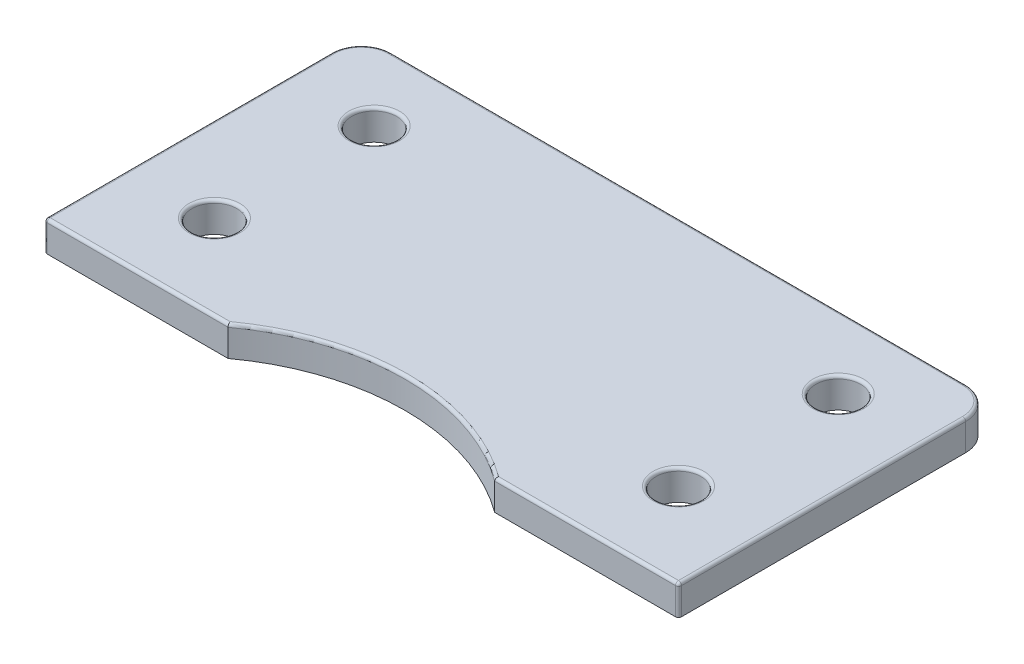
ISO-10303-21;
HEADER;
FILE_DESCRIPTION(('STEP AP214'),'2;1');
FILE_NAME('part.step','',(''),(''),'','','');
FILE_SCHEMA(('AUTOMOTIVE_DESIGN { 1 0 10303 214 1 1 1 1 }'));
ENDSEC;
DATA;
#1=APPLICATION_CONTEXT('core data for automotive mechanical design processes');
#2=APPLICATION_PROTOCOL_DEFINITION('international standard','automotive_design',2000,#1);
#3=PRODUCT_CONTEXT('',#1,'mechanical');
#4=PRODUCT('Part','Part','',(#3));
#5=PRODUCT_RELATED_PRODUCT_CATEGORY('part','',(#4));
#6=PRODUCT_DEFINITION_FORMATION('','',#4);
#7=PRODUCT_DEFINITION_CONTEXT('part definition',#1,'design');
#8=PRODUCT_DEFINITION('design','',#6,#7);
#9=PRODUCT_DEFINITION_SHAPE('','',#8);
#10=(LENGTH_UNIT() NAMED_UNIT(*) SI_UNIT(.MILLI.,.METRE.));
#11=(NAMED_UNIT(*) PLANE_ANGLE_UNIT() SI_UNIT($,.RADIAN.));
#12=(NAMED_UNIT(*) SI_UNIT($,.STERADIAN.) SOLID_ANGLE_UNIT());
#13=UNCERTAINTY_MEASURE_WITH_UNIT(LENGTH_MEASURE(1.E-05),#10,'distance_accuracy_value','');
#14=(GEOMETRIC_REPRESENTATION_CONTEXT(3) GLOBAL_UNCERTAINTY_ASSIGNED_CONTEXT((#13)) GLOBAL_UNIT_ASSIGNED_CONTEXT((#10,
#11,#12)) REPRESENTATION_CONTEXT('',''));
#15=CARTESIAN_POINT('',(0.,0.,0.));
#16=DIRECTION('',(0.,0.,1.));
#17=DIRECTION('',(1.,0.,0.));
#18=AXIS2_PLACEMENT_3D('',#15,#16,#17);
#19=CARTESIAN_POINT('',(0.,2.,33.3221138725638));
#20=DIRECTION('',(0.,1.,0.));
#21=DIRECTION('',(0.,0.,1.));
#22=AXIS2_PLACEMENT_3D('',#19,#20,#21);
#23=PLANE('',#22);
#24=CARTESIAN_POINT('',(-15.4497179784894,2.,4.84788901423793));
#25=DIRECTION('',(0.,1.,0.));
#26=DIRECTION('',(0.,0.,1.));
#27=AXIS2_PLACEMENT_3D('',#24,#25,#26);
#28=CIRCLE('',#27,1.7);
#29=CARTESIAN_POINT('',(-15.4497179784894,2.,6.54788901423793));
#30=VERTEX_POINT('',#29);
#31=EDGE_CURVE('E222',#30,#30,#28,.F.);
#32=ORIENTED_EDGE('',*,*,#31,.T.);
#33=EDGE_LOOP('',(#32));
#34=FACE_BOUND('',#33,.T.);
#35=CARTESIAN_POINT('',(15.5,2.,15.5));
#36=DIRECTION('',(0.,1.,0.));
#37=DIRECTION('',(0.,0.,1.));
#38=AXIS2_PLACEMENT_3D('',#35,#36,#37);
#39=CIRCLE('',#38,1.7);
#40=CARTESIAN_POINT('',(15.5,2.,17.2));
#41=VERTEX_POINT('',#40);
#42=EDGE_CURVE('E219',#41,#41,#39,.F.);
#43=ORIENTED_EDGE('',*,*,#42,.T.);
#44=EDGE_LOOP('',(#43));
#45=FACE_BOUND('',#44,.T.);
#46=DIRECTION('',(0.,0.,-1.));
#47=VECTOR('',#46,1.);
#48=CARTESIAN_POINT('',(20.95,2.,2.00000000000001));
#49=LINE('',#48,#47);
#50=CARTESIAN_POINT('',(20.95,2.,20.95));
#51=VERTEX_POINT('',#50);
#52=CARTESIAN_POINT('',(20.95,2.,2.));
#53=VERTEX_POINT('',#52);
#54=EDGE_CURVE('E214',#51,#53,#49,.T.);
#55=ORIENTED_EDGE('',*,*,#54,.T.);
#56=CARTESIAN_POINT('',(19.15,2.,2.));
#57=DIRECTION('',(0.,1.,0.));
#58=DIRECTION('',(0.,0.,1.));
#59=AXIS2_PLACEMENT_3D('',#56,#57,#58);
#60=CIRCLE('',#59,1.8);
#61=CARTESIAN_POINT('',(19.15,2.,0.199999999999999));
#62=VERTEX_POINT('',#61);
#63=EDGE_CURVE('E216',#53,#62,#60,.T.);
#64=ORIENTED_EDGE('',*,*,#63,.T.);
#65=DIRECTION('',(-1.,0.,0.));
#66=VECTOR('',#65,1.);
#67=CARTESIAN_POINT('',(-19.15,2.,0.199999999999999));
#68=LINE('',#67,#66);
#69=CARTESIAN_POINT('',(-19.15,2.,0.199999999999999));
#70=VERTEX_POINT('',#69);
#71=EDGE_CURVE('E202',#62,#70,#68,.T.);
#72=ORIENTED_EDGE('',*,*,#71,.T.);
#73=CARTESIAN_POINT('',(-19.15,2.,2.));
#74=DIRECTION('',(0.,1.,0.));
#75=DIRECTION('',(0.,0.,1.));
#76=AXIS2_PLACEMENT_3D('',#73,#74,#75);
#77=CIRCLE('',#76,1.8);
#78=CARTESIAN_POINT('',(-20.95,2.,2.));
#79=VERTEX_POINT('',#78);
#80=EDGE_CURVE('E204',#70,#79,#77,.T.);
#81=ORIENTED_EDGE('',*,*,#80,.T.);
#82=DIRECTION('',(0.,0.,1.));
#83=VECTOR('',#82,1.);
#84=CARTESIAN_POINT('',(-20.95,2.,21.15));
#85=LINE('',#84,#83);
#86=CARTESIAN_POINT('',(-20.95,2.,20.95));
#87=VERTEX_POINT('',#86);
#88=EDGE_CURVE('E206',#79,#87,#85,.T.);
#89=ORIENTED_EDGE('',*,*,#88,.T.);
#90=DIRECTION('',(1.,0.,0.));
#91=VECTOR('',#90,1.);
#92=CARTESIAN_POINT('',(-8.891728160656,2.,20.95));
#93=LINE('',#92,#91);
#94=CARTESIAN_POINT('',(-8.95676022610485,2.,20.95));
#95=VERTEX_POINT('',#94);
#96=EDGE_CURVE('E208',#87,#95,#93,.T.);
#97=ORIENTED_EDGE('',*,*,#96,.T.);
#98=CARTESIAN_POINT('',(0.,2.,33.3221138725638));
#99=DIRECTION('',(0.,1.,0.));
#100=DIRECTION('',(0.,0.,1.));
#101=AXIS2_PLACEMENT_3D('',#98,#99,#100);
#102=CIRCLE('',#101,15.2739240348909);
#103=CARTESIAN_POINT('',(8.95676022610484,2.,20.95));
#104=VERTEX_POINT('',#103);
#105=EDGE_CURVE('E210',#95,#104,#102,.F.);
#106=ORIENTED_EDGE('',*,*,#105,.T.);
#107=DIRECTION('',(1.,0.,0.));
#108=VECTOR('',#107,1.);
#109=CARTESIAN_POINT('',(21.15,2.,20.95));
#110=LINE('',#109,#108);
#111=EDGE_CURVE('E212',#104,#51,#110,.T.);
#112=ORIENTED_EDGE('',*,*,#111,.T.);
#113=EDGE_LOOP('',(#55,#64,#72,#81,#89,#97,#106,#112));
#114=FACE_BOUND('',#113,.T.);
#115=CARTESIAN_POINT('',(-15.4497179784894,2.,15.5));
#116=DIRECTION('',(0.,1.,0.));
#117=DIRECTION('',(0.,0.,1.));
#118=AXIS2_PLACEMENT_3D('',#115,#116,#117);
#119=CIRCLE('',#118,1.7);
#120=CARTESIAN_POINT('',(-15.4497179784894,2.,17.2));
#121=VERTEX_POINT('',#120);
#122=EDGE_CURVE('E199',#121,#121,#119,.F.);
#123=ORIENTED_EDGE('',*,*,#122,.T.);
#124=EDGE_LOOP('',(#123));
#125=FACE_BOUND('',#124,.T.);
#126=CARTESIAN_POINT('',(15.5,2.,4.84788901423793));
#127=DIRECTION('',(0.,1.,0.));
#128=DIRECTION('',(0.,0.,1.));
#129=AXIS2_PLACEMENT_3D('',#126,#127,#128);
#130=CIRCLE('',#129,1.7);
#131=CARTESIAN_POINT('',(15.5,2.,6.54788901423793));
#132=VERTEX_POINT('',#131);
#133=EDGE_CURVE('E196',#132,#132,#130,.F.);
#134=ORIENTED_EDGE('',*,*,#133,.T.);
#135=EDGE_LOOP('',(#134));
#136=FACE_BOUND('',#135,.T.);
#137=ADVANCED_FACE('F33',(#34,#45,#114,#125,#136),#23,.T.);
#138=CARTESIAN_POINT('',(0.,0.,33.3221138725638));
#139=DIRECTION('',(0.,1.,0.));
#140=DIRECTION('',(0.,0.,1.));
#141=AXIS2_PLACEMENT_3D('',#138,#139,#140);
#142=PLANE('',#141);
#143=DIRECTION('',(1.,0.,0.));
#144=VECTOR('',#143,1.);
#145=CARTESIAN_POINT('',(-21.15,0.,21.15));
#146=LINE('',#145,#144);
#147=CARTESIAN_POINT('',(-20.95,0.,21.15));
#148=VERTEX_POINT('',#147);
#149=CARTESIAN_POINT('',(-8.891728160656,0.,21.15));
#150=VERTEX_POINT('',#149);
#151=EDGE_CURVE('E143',#148,#150,#146,.T.);
#152=ORIENTED_EDGE('',*,*,#151,.F.);
#153=CARTESIAN_POINT('',(-20.95,0.,20.95));
#154=DIRECTION('',(0.,1.,0.));
#155=DIRECTION('',(0.,0.,1.));
#156=AXIS2_PLACEMENT_3D('',#153,#154,#155);
#157=CIRCLE('',#156,0.2);
#158=CARTESIAN_POINT('',(-21.15,0.,20.95));
#159=VERTEX_POINT('',#158);
#160=EDGE_CURVE('E11',#148,#159,#157,.F.);
#161=ORIENTED_EDGE('',*,*,#160,.T.);
#162=DIRECTION('',(0.,0.,1.));
#163=VECTOR('',#162,1.);
#164=CARTESIAN_POINT('',(-21.15,0.,0.));
#165=LINE('',#164,#163);
#166=CARTESIAN_POINT('',(-21.15,0.,2.));
#167=VERTEX_POINT('',#166);
#168=EDGE_CURVE('E154',#167,#159,#165,.T.);
#169=ORIENTED_EDGE('',*,*,#168,.F.);
#170=CARTESIAN_POINT('',(-19.15,0.,2.));
#171=DIRECTION('',(0.,1.,0.));
#172=DIRECTION('',(0.,0.,1.));
#173=AXIS2_PLACEMENT_3D('',#170,#171,#172);
#174=CIRCLE('',#173,2.);
#175=CARTESIAN_POINT('',(-19.15,0.,0.));
#176=VERTEX_POINT('',#175);
#177=EDGE_CURVE('E184',#167,#176,#174,.F.);
#178=ORIENTED_EDGE('',*,*,#177,.T.);
#179=DIRECTION('',(-1.,0.,0.));
#180=VECTOR('',#179,1.);
#181=CARTESIAN_POINT('',(21.15,0.,0.));
#182=LINE('',#181,#180);
#183=CARTESIAN_POINT('',(19.15,0.,0.));
#184=VERTEX_POINT('',#183);
#185=EDGE_CURVE('E176',#184,#176,#182,.T.);
#186=ORIENTED_EDGE('',*,*,#185,.F.);
#187=CARTESIAN_POINT('',(19.15,0.,2.));
#188=DIRECTION('',(0.,1.,0.));
#189=DIRECTION('',(0.,0.,1.));
#190=AXIS2_PLACEMENT_3D('',#187,#188,#189);
#191=CIRCLE('',#190,2.);
#192=CARTESIAN_POINT('',(21.15,0.,2.00000000000001));
#193=VERTEX_POINT('',#192);
#194=EDGE_CURVE('E181',#184,#193,#191,.F.);
#195=ORIENTED_EDGE('',*,*,#194,.T.);
#196=DIRECTION('',(0.,0.,-1.));
#197=VECTOR('',#196,1.);
#198=CARTESIAN_POINT('',(21.15,0.,21.15));
#199=LINE('',#198,#197);
#200=CARTESIAN_POINT('',(21.15,0.,20.95));
#201=VERTEX_POINT('',#200);
#202=EDGE_CURVE('E171',#201,#193,#199,.T.);
#203=ORIENTED_EDGE('',*,*,#202,.F.);
#204=CARTESIAN_POINT('',(20.95,0.,20.95));
#205=DIRECTION('',(0.,1.,0.));
#206=DIRECTION('',(0.,0.,1.));
#207=AXIS2_PLACEMENT_3D('',#204,#205,#206);
#208=CIRCLE('',#207,0.2);
#209=CARTESIAN_POINT('',(20.95,0.,21.15));
#210=VERTEX_POINT('',#209);
#211=EDGE_CURVE('E47',#201,#210,#208,.F.);
#212=ORIENTED_EDGE('',*,*,#211,.T.);
#213=DIRECTION('',(1.,0.,0.));
#214=VECTOR('',#213,1.);
#215=CARTESIAN_POINT('',(8.89172816065599,0.,21.15));
#216=LINE('',#215,#214);
#217=CARTESIAN_POINT('',(8.89172816065599,0.,21.15));
#218=VERTEX_POINT('',#217);
#219=EDGE_CURVE('E169',#218,#210,#216,.T.);
#220=ORIENTED_EDGE('',*,*,#219,.F.);
#221=CARTESIAN_POINT('',(0.,0.,33.3221138725638));
#222=DIRECTION('',(0.,-1.,0.));
#223=DIRECTION('',(0.,0.,1.));
#224=AXIS2_PLACEMENT_3D('',#221,#222,#223);
#225=CIRCLE('',#224,15.0739240348909);
#226=EDGE_CURVE('E153',#150,#218,#225,.T.);
#227=ORIENTED_EDGE('',*,*,#226,.F.);
#228=EDGE_LOOP('',(#152,#161,#169,#178,#186,#195,#203,#212,#220,#227));
#229=FACE_BOUND('',#228,.T.);
#230=CARTESIAN_POINT('',(-15.4497179784894,0.,15.5));
#231=DIRECTION('',(0.,1.,0.));
#232=DIRECTION('',(0.,0.,1.));
#233=AXIS2_PLACEMENT_3D('',#230,#231,#232);
#234=CIRCLE('',#233,1.5);
#235=CARTESIAN_POINT('',(-15.4497179784894,0.,17.));
#236=VERTEX_POINT('',#235);
#237=EDGE_CURVE('E414',#236,#236,#234,.T.);
#238=ORIENTED_EDGE('',*,*,#237,.T.);
#239=EDGE_LOOP('',(#238));
#240=FACE_BOUND('',#239,.T.);
#241=CARTESIAN_POINT('',(15.5,0.,15.5));
#242=DIRECTION('',(0.,1.,0.));
#243=DIRECTION('',(0.,0.,1.));
#244=AXIS2_PLACEMENT_3D('',#241,#242,#243);
#245=CIRCLE('',#244,1.5);
#246=CARTESIAN_POINT('',(15.5,0.,17.));
#247=VERTEX_POINT('',#246);
#248=EDGE_CURVE('E409',#247,#247,#245,.T.);
#249=ORIENTED_EDGE('',*,*,#248,.T.);
#250=EDGE_LOOP('',(#249));
#251=FACE_BOUND('',#250,.T.);
#252=CARTESIAN_POINT('',(15.5,0.,4.84788901423793));
#253=DIRECTION('',(0.,1.,0.));
#254=DIRECTION('',(0.,0.,1.));
#255=AXIS2_PLACEMENT_3D('',#252,#253,#254);
#256=CIRCLE('',#255,1.5);
#257=CARTESIAN_POINT('',(15.5,0.,6.34788901423793));
#258=VERTEX_POINT('',#257);
#259=EDGE_CURVE('E404',#258,#258,#256,.T.);
#260=ORIENTED_EDGE('',*,*,#259,.T.);
#261=EDGE_LOOP('',(#260));
#262=FACE_BOUND('',#261,.T.);
#263=CARTESIAN_POINT('',(-15.4497179784894,0.,4.84788901423793));
#264=DIRECTION('',(0.,1.,0.));
#265=DIRECTION('',(0.,0.,1.));
#266=AXIS2_PLACEMENT_3D('',#263,#264,#265);
#267=CIRCLE('',#266,1.5);
#268=CARTESIAN_POINT('',(-15.4497179784894,0.,6.34788901423793));
#269=VERTEX_POINT('',#268);
#270=EDGE_CURVE('E399',#269,#269,#267,.T.);
#271=ORIENTED_EDGE('',*,*,#270,.T.);
#272=EDGE_LOOP('',(#271));
#273=FACE_BOUND('',#272,.T.);
#274=ADVANCED_FACE('F166',(#229,#240,#251,#262,#273),#142,.F.);
#275=CARTESIAN_POINT('',(-21.15,2.,0.));
#276=DIRECTION('',(1.,0.,0.));
#277=DIRECTION('',(0.,0.,-1.));
#278=AXIS2_PLACEMENT_3D('',#275,#276,#277);
#279=PLANE('',#278);
#280=DIRECTION('',(0.,-1.,0.));
#281=VECTOR('',#280,1.);
#282=CARTESIAN_POINT('',(-21.15,2.,20.95));
#283=LINE('',#282,#281);
#284=CARTESIAN_POINT('',(-21.15,1.8,20.95));
#285=VERTEX_POINT('',#284);
#286=EDGE_CURVE('E63',#159,#285,#283,.F.);
#287=ORIENTED_EDGE('',*,*,#286,.T.);
#288=DIRECTION('',(0.,0.,1.));
#289=VECTOR('',#288,1.);
#290=CARTESIAN_POINT('',(-21.15,1.8,2.));
#291=LINE('',#290,#289);
#292=CARTESIAN_POINT('',(-21.15,1.8,2.));
#293=VERTEX_POINT('',#292);
#294=EDGE_CURVE('E244',#285,#293,#291,.F.);
#295=ORIENTED_EDGE('',*,*,#294,.T.);
#296=DIRECTION('',(0.,-1.,0.));
#297=VECTOR('',#296,1.);
#298=CARTESIAN_POINT('',(-21.15,2.,2.));
#299=LINE('',#298,#297);
#300=EDGE_CURVE('E163',#293,#167,#299,.T.);
#301=ORIENTED_EDGE('',*,*,#300,.T.);
#302=ORIENTED_EDGE('',*,*,#168,.T.);
#303=EDGE_LOOP('',(#287,#295,#301,#302));
#304=FACE_BOUND('',#303,.T.);
#305=ADVANCED_FACE('F331',(#304),#279,.F.);
#306=CARTESIAN_POINT('',(-21.15,2.,21.15));
#307=DIRECTION('',(0.,0.,-1.));
#308=DIRECTION('',(-1.,0.,0.));
#309=AXIS2_PLACEMENT_3D('',#306,#307,#308);
#310=PLANE('',#309);
#311=DIRECTION('',(0.,-1.,0.));
#312=VECTOR('',#311,1.);
#313=CARTESIAN_POINT('',(-8.891728160656,2.,21.15));
#314=LINE('',#313,#312);
#315=CARTESIAN_POINT('',(-8.891728160656,1.8,21.15));
#316=VERTEX_POINT('',#315);
#317=EDGE_CURVE('E146',#316,#150,#314,.T.);
#318=ORIENTED_EDGE('',*,*,#317,.F.);
#319=DIRECTION('',(1.,0.,0.));
#320=VECTOR('',#319,1.);
#321=CARTESIAN_POINT('',(-21.15,1.8,21.15));
#322=LINE('',#321,#320);
#323=CARTESIAN_POINT('',(-20.95,1.8,21.15));
#324=VERTEX_POINT('',#323);
#325=EDGE_CURVE('E241',#316,#324,#322,.F.);
#326=ORIENTED_EDGE('',*,*,#325,.T.);
#327=DIRECTION('',(0.,-1.,0.));
#328=VECTOR('',#327,1.);
#329=CARTESIAN_POINT('',(-20.95,2.,21.15));
#330=LINE('',#329,#328);
#331=EDGE_CURVE('E149',#324,#148,#330,.T.);
#332=ORIENTED_EDGE('',*,*,#331,.T.);
#333=ORIENTED_EDGE('',*,*,#151,.T.);
#334=EDGE_LOOP('',(#318,#326,#332,#333));
#335=FACE_BOUND('',#334,.T.);
#336=ADVANCED_FACE('F145',(#335),#310,.F.);
#337=CARTESIAN_POINT('',(0.,2.,33.3221138725638));
#338=DIRECTION('',(0.,-1.,0.));
#339=DIRECTION('',(0.,0.,-1.));
#340=AXIS2_PLACEMENT_3D('',#337,#338,#339);
#341=CYLINDRICAL_SURFACE('',#340,15.0739240348909);
#342=DIRECTION('',(0.,-1.,0.));
#343=VECTOR('',#342,1.);
#344=CARTESIAN_POINT('',(8.89172816065599,2.,21.15));
#345=LINE('',#344,#343);
#346=CARTESIAN_POINT('',(8.89172816065599,1.8,21.15));
#347=VERTEX_POINT('',#346);
#348=EDGE_CURVE('E164',#347,#218,#345,.T.);
#349=ORIENTED_EDGE('',*,*,#348,.F.);
#350=CARTESIAN_POINT('',(0.,1.8,33.3221138725638));
#351=DIRECTION('',(0.,1.,0.));
#352=DIRECTION('',(0.,0.,1.));
#353=AXIS2_PLACEMENT_3D('',#350,#351,#352);
#354=CIRCLE('',#353,15.0739240348909);
#355=EDGE_CURVE('E162',#347,#316,#354,.T.);
#356=ORIENTED_EDGE('',*,*,#355,.T.);
#357=ORIENTED_EDGE('',*,*,#317,.T.);
#358=ORIENTED_EDGE('',*,*,#226,.T.);
#359=EDGE_LOOP('',(#349,#356,#357,#358));
#360=FACE_BOUND('',#359,.T.);
#361=ADVANCED_FACE('F159',(#360),#341,.F.);
#362=CARTESIAN_POINT('',(8.89172816065599,2.,21.15));
#363=DIRECTION('',(0.,0.,-1.));
#364=DIRECTION('',(-1.,0.,0.));
#365=AXIS2_PLACEMENT_3D('',#362,#363,#364);
#366=PLANE('',#365);
#367=DIRECTION('',(0.,-1.,0.));
#368=VECTOR('',#367,1.);
#369=CARTESIAN_POINT('',(20.95,2.,21.15));
#370=LINE('',#369,#368);
#371=CARTESIAN_POINT('',(20.95,1.8,21.15));
#372=VERTEX_POINT('',#371);
#373=EDGE_CURVE('E235',#210,#372,#370,.F.);
#374=ORIENTED_EDGE('',*,*,#373,.T.);
#375=DIRECTION('',(1.,0.,0.));
#376=VECTOR('',#375,1.);
#377=CARTESIAN_POINT('',(8.89172816065599,1.8,21.15));
#378=LINE('',#377,#376);
#379=EDGE_CURVE('E237',#372,#347,#378,.F.);
#380=ORIENTED_EDGE('',*,*,#379,.T.);
#381=ORIENTED_EDGE('',*,*,#348,.T.);
#382=ORIENTED_EDGE('',*,*,#219,.T.);
#383=EDGE_LOOP('',(#374,#380,#381,#382));
#384=FACE_BOUND('',#383,.T.);
#385=ADVANCED_FACE('F345',(#384),#366,.F.);
#386=CARTESIAN_POINT('',(21.15,2.,21.15));
#387=DIRECTION('',(-1.,0.,0.));
#388=DIRECTION('',(0.,0.,1.));
#389=AXIS2_PLACEMENT_3D('',#386,#387,#388);
#390=PLANE('',#389);
#391=DIRECTION('',(0.,-1.,0.));
#392=VECTOR('',#391,1.);
#393=CARTESIAN_POINT('',(21.15,2.,2.));
#394=LINE('',#393,#392);
#395=CARTESIAN_POINT('',(21.15,1.8,2.));
#396=VERTEX_POINT('',#395);
#397=EDGE_CURVE('E190',#193,#396,#394,.F.);
#398=ORIENTED_EDGE('',*,*,#397,.T.);
#399=DIRECTION('',(0.,0.,-1.));
#400=VECTOR('',#399,1.);
#401=CARTESIAN_POINT('',(21.15,1.8,21.15));
#402=LINE('',#401,#400);
#403=CARTESIAN_POINT('',(21.15,1.8,20.95));
#404=VERTEX_POINT('',#403);
#405=EDGE_CURVE('E233',#396,#404,#402,.F.);
#406=ORIENTED_EDGE('',*,*,#405,.T.);
#407=DIRECTION('',(0.,-1.,0.));
#408=VECTOR('',#407,1.);
#409=CARTESIAN_POINT('',(21.15,2.,20.95));
#410=LINE('',#409,#408);
#411=EDGE_CURVE('E231',#404,#201,#410,.T.);
#412=ORIENTED_EDGE('',*,*,#411,.T.);
#413=ORIENTED_EDGE('',*,*,#202,.T.);
#414=EDGE_LOOP('',(#398,#406,#412,#413));
#415=FACE_BOUND('',#414,.T.);
#416=ADVANCED_FACE('F341',(#415),#390,.F.);
#417=CARTESIAN_POINT('',(21.15,2.,0.));
#418=DIRECTION('',(0.,0.,1.));
#419=DIRECTION('',(1.,0.,0.));
#420=AXIS2_PLACEMENT_3D('',#417,#418,#419);
#421=PLANE('',#420);
#422=DIRECTION('',(0.,-1.,0.));
#423=VECTOR('',#422,1.);
#424=CARTESIAN_POINT('',(-19.15,2.,0.));
#425=LINE('',#424,#423);
#426=CARTESIAN_POINT('',(-19.15,1.8,0.));
#427=VERTEX_POINT('',#426);
#428=EDGE_CURVE('E188',#176,#427,#425,.F.);
#429=ORIENTED_EDGE('',*,*,#428,.T.);
#430=DIRECTION('',(-1.,0.,0.));
#431=VECTOR('',#430,1.);
#432=CARTESIAN_POINT('',(19.15,1.8,0.));
#433=LINE('',#432,#431);
#434=CARTESIAN_POINT('',(19.15,1.8,0.));
#435=VERTEX_POINT('',#434);
#436=EDGE_CURVE('E247',#427,#435,#433,.F.);
#437=ORIENTED_EDGE('',*,*,#436,.T.);
#438=DIRECTION('',(0.,-1.,0.));
#439=VECTOR('',#438,1.);
#440=CARTESIAN_POINT('',(19.15,2.,0.));
#441=LINE('',#440,#439);
#442=EDGE_CURVE('E186',#435,#184,#441,.T.);
#443=ORIENTED_EDGE('',*,*,#442,.T.);
#444=ORIENTED_EDGE('',*,*,#185,.T.);
#445=EDGE_LOOP('',(#429,#437,#443,#444));
#446=FACE_BOUND('',#445,.T.);
#447=ADVANCED_FACE('F338',(#446),#421,.F.);
#448=CARTESIAN_POINT('',(-15.4497179784894,2.,15.5));
#449=DIRECTION('',(0.,-1.,0.));
#450=DIRECTION('',(0.,0.,-1.));
#451=AXIS2_PLACEMENT_3D('',#448,#449,#450);
#452=CYLINDRICAL_SURFACE('',#451,1.5);
#453=CARTESIAN_POINT('',(-15.4497179784894,1.8,15.5));
#454=DIRECTION('',(0.,1.,0.));
#455=DIRECTION('',(0.,0.,1.));
#456=AXIS2_PLACEMENT_3D('',#453,#454,#455);
#457=CIRCLE('',#456,1.5);
#458=CARTESIAN_POINT('',(-15.4497179784894,1.8,17.));
#459=VERTEX_POINT('',#458);
#460=EDGE_CURVE('E249',#459,#459,#457,.T.);
#461=ORIENTED_EDGE('',*,*,#460,.T.);
#462=EDGE_LOOP('',(#461));
#463=FACE_BOUND('',#462,.T.);
#464=ORIENTED_EDGE('',*,*,#237,.F.);
#465=EDGE_LOOP('',(#464));
#466=FACE_BOUND('',#465,.T.);
#467=ADVANCED_FACE('F335',(#463,#466),#452,.F.);
#468=CARTESIAN_POINT('',(15.5,2.,15.5));
#469=DIRECTION('',(0.,-1.,0.));
#470=DIRECTION('',(0.,0.,-1.));
#471=AXIS2_PLACEMENT_3D('',#468,#469,#470);
#472=CYLINDRICAL_SURFACE('',#471,1.5);
#473=CARTESIAN_POINT('',(15.5,1.8,15.5));
#474=DIRECTION('',(0.,1.,0.));
#475=DIRECTION('',(0.,0.,1.));
#476=AXIS2_PLACEMENT_3D('',#473,#474,#475);
#477=CIRCLE('',#476,1.5);
#478=CARTESIAN_POINT('',(15.5,1.8,17.));
#479=VERTEX_POINT('',#478);
#480=EDGE_CURVE('E225',#479,#479,#477,.T.);
#481=ORIENTED_EDGE('',*,*,#480,.T.);
#482=EDGE_LOOP('',(#481));
#483=FACE_BOUND('',#482,.T.);
#484=ORIENTED_EDGE('',*,*,#248,.F.);
#485=EDGE_LOOP('',(#484));
#486=FACE_BOUND('',#485,.T.);
#487=ADVANCED_FACE('F452',(#483,#486),#472,.F.);
#488=CARTESIAN_POINT('',(15.5,2.,4.84788901423793));
#489=DIRECTION('',(0.,-1.,0.));
#490=DIRECTION('',(0.,0.,-1.));
#491=AXIS2_PLACEMENT_3D('',#488,#489,#490);
#492=CYLINDRICAL_SURFACE('',#491,1.5);
#493=CARTESIAN_POINT('',(15.5,1.8,4.84788901423793));
#494=DIRECTION('',(0.,1.,0.));
#495=DIRECTION('',(0.,0.,1.));
#496=AXIS2_PLACEMENT_3D('',#493,#494,#495);
#497=CIRCLE('',#496,1.5);
#498=CARTESIAN_POINT('',(15.5,1.8,6.34788901423793));
#499=VERTEX_POINT('',#498);
#500=EDGE_CURVE('E252',#499,#499,#497,.T.);
#501=ORIENTED_EDGE('',*,*,#500,.T.);
#502=EDGE_LOOP('',(#501));
#503=FACE_BOUND('',#502,.T.);
#504=ORIENTED_EDGE('',*,*,#259,.F.);
#505=EDGE_LOOP('',(#504));
#506=FACE_BOUND('',#505,.T.);
#507=ADVANCED_FACE('F449',(#503,#506),#492,.F.);
#508=CARTESIAN_POINT('',(-15.4497179784894,2.,4.84788901423793));
#509=DIRECTION('',(0.,-1.,0.));
#510=DIRECTION('',(0.,0.,-1.));
#511=AXIS2_PLACEMENT_3D('',#508,#509,#510);
#512=CYLINDRICAL_SURFACE('',#511,1.5);
#513=CARTESIAN_POINT('',(-15.4497179784894,1.8,4.84788901423793));
#514=DIRECTION('',(0.,1.,0.));
#515=DIRECTION('',(0.,0.,1.));
#516=AXIS2_PLACEMENT_3D('',#513,#514,#515);
#517=CIRCLE('',#516,1.5);
#518=CARTESIAN_POINT('',(-15.4497179784894,1.8,6.34788901423793));
#519=VERTEX_POINT('',#518);
#520=EDGE_CURVE('E193',#519,#519,#517,.T.);
#521=ORIENTED_EDGE('',*,*,#520,.T.);
#522=EDGE_LOOP('',(#521));
#523=FACE_BOUND('',#522,.T.);
#524=ORIENTED_EDGE('',*,*,#270,.F.);
#525=EDGE_LOOP('',(#524));
#526=FACE_BOUND('',#525,.T.);
#527=ADVANCED_FACE('F360',(#523,#526),#512,.F.);
#528=CARTESIAN_POINT('',(-19.15,2.,2.));
#529=DIRECTION('',(0.,-1.,0.));
#530=DIRECTION('',(0.,0.,-1.));
#531=AXIS2_PLACEMENT_3D('',#528,#529,#530);
#532=CYLINDRICAL_SURFACE('',#531,2.);
#533=ORIENTED_EDGE('',*,*,#300,.F.);
#534=CARTESIAN_POINT('',(-19.15,1.8,2.));
#535=DIRECTION('',(0.,1.,0.));
#536=DIRECTION('',(0.,0.,1.));
#537=AXIS2_PLACEMENT_3D('',#534,#535,#536);
#538=CIRCLE('',#537,2.);
#539=EDGE_CURVE('E55',#293,#427,#538,.F.);
#540=ORIENTED_EDGE('',*,*,#539,.T.);
#541=ORIENTED_EDGE('',*,*,#428,.F.);
#542=ORIENTED_EDGE('',*,*,#177,.F.);
#543=EDGE_LOOP('',(#533,#540,#541,#542));
#544=FACE_BOUND('',#543,.T.);
#545=ADVANCED_FACE('F356',(#544),#532,.T.);
#546=CARTESIAN_POINT('',(19.15,2.,2.));
#547=DIRECTION('',(0.,-1.,0.));
#548=DIRECTION('',(0.,0.,-1.));
#549=AXIS2_PLACEMENT_3D('',#546,#547,#548);
#550=CYLINDRICAL_SURFACE('',#549,2.);
#551=ORIENTED_EDGE('',*,*,#442,.F.);
#552=CARTESIAN_POINT('',(19.15,1.8,2.));
#553=DIRECTION('',(0.,1.,0.));
#554=DIRECTION('',(0.,0.,1.));
#555=AXIS2_PLACEMENT_3D('',#552,#553,#554);
#556=CIRCLE('',#555,2.);
#557=EDGE_CURVE('E228',#435,#396,#556,.F.);
#558=ORIENTED_EDGE('',*,*,#557,.T.);
#559=ORIENTED_EDGE('',*,*,#397,.F.);
#560=ORIENTED_EDGE('',*,*,#194,.F.);
#561=EDGE_LOOP('',(#551,#558,#559,#560));
#562=FACE_BOUND('',#561,.T.);
#563=ADVANCED_FACE('F359',(#562),#550,.T.);
#564=CARTESIAN_POINT('',(-15.4497179784894,1.8,4.84788901423793));
#565=DIRECTION('',(0.,1.,0.));
#566=DIRECTION('',(0.,0.,1.));
#567=AXIS2_PLACEMENT_3D('',#564,#565,#566);
#568=TOROIDAL_SURFACE('',#567,1.7,0.2);
#569=ORIENTED_EDGE('',*,*,#31,.F.);
#570=EDGE_LOOP('',(#569));
#571=FACE_BOUND('',#570,.T.);
#572=ORIENTED_EDGE('',*,*,#520,.F.);
#573=EDGE_LOOP('',(#572));
#574=FACE_BOUND('',#573,.T.);
#575=ADVANCED_FACE('F363',(#571,#574),#568,.T.);
#576=CARTESIAN_POINT('',(15.5,1.8,15.5));
#577=DIRECTION('',(0.,1.,0.));
#578=DIRECTION('',(0.,0.,1.));
#579=AXIS2_PLACEMENT_3D('',#576,#577,#578);
#580=TOROIDAL_SURFACE('',#579,1.7,0.2);
#581=ORIENTED_EDGE('',*,*,#42,.F.);
#582=EDGE_LOOP('',(#581));
#583=FACE_BOUND('',#582,.T.);
#584=ORIENTED_EDGE('',*,*,#480,.F.);
#585=EDGE_LOOP('',(#584));
#586=FACE_BOUND('',#585,.T.);
#587=ADVANCED_FACE('F307',(#583,#586),#580,.T.);
#588=CARTESIAN_POINT('',(0.,1.8,20.95));
#589=DIRECTION('',(-1.,0.,0.));
#590=DIRECTION('',(0.,0.,1.));
#591=AXIS2_PLACEMENT_3D('',#588,#589,#590);
#592=CYLINDRICAL_SURFACE('',#591,0.2);
#593=CARTESIAN_POINT('',(-20.95,1.8,20.95));
#594=DIRECTION('',(-1.,0.,0.));
#595=DIRECTION('',(0.,0.,1.));
#596=AXIS2_PLACEMENT_3D('',#593,#594,#595);
#597=CIRCLE('',#596,0.2);
#598=EDGE_CURVE('E396',#324,#87,#597,.T.);
#599=ORIENTED_EDGE('',*,*,#598,.F.);
#600=ORIENTED_EDGE('',*,*,#325,.F.);
#601=CARTESIAN_POINT('',(-8.891728160656,1.8,21.15));
#602=CARTESIAN_POINT('',(-8.89172444520026,1.81085217440409,21.1500112177331));
#603=CARTESIAN_POINT('',(-8.89201616954976,1.8216982245568,21.1491174815231));
#604=CARTESIAN_POINT('',(-8.89316187402287,1.84305465951153,21.1456065609452));
#605=CARTESIAN_POINT('',(-8.89401467217329,1.85356570135372,21.1429929996051));
#606=CARTESIAN_POINT('',(-8.89625410583931,1.8739766987547,21.1361282688136));
#607=CARTESIAN_POINT('',(-8.8976407359171,1.88387666053695,21.1318771160432));
#608=CARTESIAN_POINT('',(-8.900898232134,1.9028073715418,21.1218870316013));
#609=CARTESIAN_POINT('',(-8.90276917772604,1.91183797781106,21.1161478558163));
#610=CARTESIAN_POINT('',(-8.90697837156596,1.92898809581584,21.1032309987574));
#611=CARTESIAN_POINT('',(-8.9093255702561,1.93708461749103,21.0960257563689));
#612=CARTESIAN_POINT('',(-8.91438921355751,1.9519613082753,21.0804746104247));
#613=CARTESIAN_POINT('',(-8.91710579277375,1.95874099532289,21.0721282910461));
#614=CARTESIAN_POINT('',(-8.92296487206471,1.9711270463698,21.0541178738872));
#615=CARTESIAN_POINT('',(-8.92612136043318,1.97666359534936,21.0444103683966));
#616=CARTESIAN_POINT('',(-8.93266426870479,1.98602730480539,21.0242766523508));
#617=CARTESIAN_POINT('',(-8.93605065124779,1.98985474226739,21.0138505585695));
#618=CARTESIAN_POINT('',(-8.94213896260437,1.99503195372971,20.9950945228175));
#619=CARTESIAN_POINT('',(-8.94481227230367,1.99675439809008,20.9868553477322));
#620=CARTESIAN_POINT('',(-8.95019792485285,1.99914847253047,20.9702490972877));
#621=CARTESIAN_POINT('',(-8.9529101912733,1.99982193484372,20.9618822707738));
#622=CARTESIAN_POINT('',(-8.95600129326838,1.9999897337835,20.9523424567606));
#623=CARTESIAN_POINT('',(-8.95638079717822,2.00000002657395,20.9511711502376));
#624=CARTESIAN_POINT('',(-8.95676022610485,2.,20.95));
#625=B_SPLINE_CURVE_WITH_KNOTS('',3,(#601,#602,#603,#604,#605,#606,#607,#608,#609,#610,#611,
#612,#613,#614,#615,#616,#617,#618,#619,#620,#621,#622,#623,#624),.UNSPECIFIED.,.F.,.F.,(4,2,2,
2,2,2,2,2,2,2,2,4),(0.,0.0325064864820961,0.0649447122524939,0.0973826076046565,
0.12982582783539,0.162947200129586,0.196080674603482,0.230765791815853,0.265445285775759,
0.291882259145618,0.318273003661365,0.321966689875995),.UNSPECIFIED.);
#626=EDGE_CURVE('E37',#95,#316,#625,.F.);
#627=ORIENTED_EDGE('',*,*,#626,.F.);
#628=ORIENTED_EDGE('',*,*,#96,.F.);
#629=EDGE_LOOP('',(#599,#600,#627,#628));
#630=FACE_BOUND('',#629,.T.);
#631=ADVANCED_FACE('F302',(#630),#592,.T.);
#632=CARTESIAN_POINT('',(-20.95,2.,20.95));
#633=DIRECTION('',(0.,-1.,0.));
#634=DIRECTION('',(0.,0.,-1.));
#635=AXIS2_PLACEMENT_3D('',#632,#633,#634);
#636=CYLINDRICAL_SURFACE('',#635,0.2);
#637=ORIENTED_EDGE('',*,*,#160,.F.);
#638=ORIENTED_EDGE('',*,*,#331,.F.);
#639=CARTESIAN_POINT('',(-20.95,1.8,20.95));
#640=DIRECTION('',(0.,1.,0.));
#641=DIRECTION('',(0.,0.,1.));
#642=AXIS2_PLACEMENT_3D('',#639,#640,#641);
#643=CIRCLE('',#642,0.2);
#644=EDGE_CURVE('E285',#285,#324,#643,.T.);
#645=ORIENTED_EDGE('',*,*,#644,.F.);
#646=ORIENTED_EDGE('',*,*,#286,.F.);
#647=EDGE_LOOP('',(#637,#638,#645,#646));
#648=FACE_BOUND('',#647,.T.);
#649=ADVANCED_FACE('F306',(#648),#636,.T.);
#650=CARTESIAN_POINT('',(0.,1.8,33.3221138725638));
#651=DIRECTION('',(0.,1.,0.));
#652=DIRECTION('',(0.,0.,1.));
#653=AXIS2_PLACEMENT_3D('',#650,#651,#652);
#654=TOROIDAL_SURFACE('',#653,15.2739240348909,0.2);
#655=ORIENTED_EDGE('',*,*,#626,.T.);
#656=ORIENTED_EDGE('',*,*,#355,.F.);
#657=CARTESIAN_POINT('',(8.89172816065599,1.8,21.15));
#658=CARTESIAN_POINT('',(8.89172444520024,1.81085217440409,21.1500112177331));
#659=CARTESIAN_POINT('',(8.89201616954974,1.8216982245568,21.1491174815231));
#660=CARTESIAN_POINT('',(8.89316187402286,1.84305465951153,21.1456065609452));
#661=CARTESIAN_POINT('',(8.89401467217328,1.85356570135373,21.1429929996051));
#662=CARTESIAN_POINT('',(8.89625410583929,1.8739766987547,21.1361282688136));
#663=CARTESIAN_POINT('',(8.89764073591709,1.88387666053695,21.1318771160432));
#664=CARTESIAN_POINT('',(8.90089823213399,1.9028073715418,21.1218870316013));
#665=CARTESIAN_POINT('',(8.90276917772603,1.91183797781106,21.1161478558163));
#666=CARTESIAN_POINT('',(8.90697837156594,1.92898809581584,21.1032309987574));
#667=CARTESIAN_POINT('',(8.90932557025608,1.93708461749103,21.0960257563689));
#668=CARTESIAN_POINT('',(8.9143892135575,1.9519613082753,21.0804746104247));
#669=CARTESIAN_POINT('',(8.91710579277374,1.95874099532289,21.0721282910461));
#670=CARTESIAN_POINT('',(8.92296487206469,1.9711270463698,21.0541178738872));
#671=CARTESIAN_POINT('',(8.92612136043317,1.97666359534936,21.0444103683966));
#672=CARTESIAN_POINT('',(8.93266426870478,1.98602730480539,21.0242766523508));
#673=CARTESIAN_POINT('',(8.93605065124777,1.98985474226739,21.0138505585695));
#674=CARTESIAN_POINT('',(8.94213896260436,1.99503195372971,20.9950945228175));
#675=CARTESIAN_POINT('',(8.94481227230366,1.99675439809008,20.9868553477322));
#676=CARTESIAN_POINT('',(8.95019792485284,1.99914847253047,20.9702490972877));
#677=CARTESIAN_POINT('',(8.9529101912733,1.99982193484372,20.9618822707738));
#678=CARTESIAN_POINT('',(8.95600129326836,1.9999897337835,20.9523424567606));
#679=CARTESIAN_POINT('',(8.95638079717821,2.00000002657395,20.9511711502376));
#680=CARTESIAN_POINT('',(8.95676022610484,2.,20.95));
#681=B_SPLINE_CURVE_WITH_KNOTS('',3,(#657,#658,#659,#660,#661,#662,#663,#664,#665,#666,#667,
#668,#669,#670,#671,#672,#673,#674,#675,#676,#677,#678,#679,#680),.UNSPECIFIED.,.F.,.F.,(4,2,2,
2,2,2,2,2,2,2,2,4),(0.,0.0325064864820959,0.0649447122524937,0.0973826076046583,
0.12982582783539,0.162947200129585,0.196080674603481,0.230765791815855,0.265445285775763,
0.291882259145621,0.318273003661361,0.321966689875994),.UNSPECIFIED.);
#682=EDGE_CURVE('E278',#104,#347,#681,.F.);
#683=ORIENTED_EDGE('',*,*,#682,.F.);
#684=ORIENTED_EDGE('',*,*,#105,.F.);
#685=EDGE_LOOP('',(#655,#656,#683,#684));
#686=FACE_BOUND('',#685,.T.);
#687=ADVANCED_FACE('F286',(#686),#654,.T.);
#688=CARTESIAN_POINT('',(-20.95,1.8,20.95));
#689=DIRECTION('',(0.,0.,1.));
#690=DIRECTION('',(1.,0.,0.));
#691=AXIS2_PLACEMENT_3D('',#688,#689,#690);
#692=SPHERICAL_SURFACE('',#691,0.2);
#693=ORIENTED_EDGE('',*,*,#644,.T.);
#694=ORIENTED_EDGE('',*,*,#598,.T.);
#695=CARTESIAN_POINT('',(-20.95,1.8,20.95));
#696=DIRECTION('',(0.,0.,1.));
#697=DIRECTION('',(1.,0.,0.));
#698=AXIS2_PLACEMENT_3D('',#695,#696,#697);
#699=CIRCLE('',#698,0.2);
#700=EDGE_CURVE('E275',#285,#87,#699,.F.);
#701=ORIENTED_EDGE('',*,*,#700,.F.);
#702=EDGE_LOOP('',(#693,#694,#701));
#703=FACE_BOUND('',#702,.T.);
#704=ADVANCED_FACE('F298',(#703),#692,.T.);
#705=CARTESIAN_POINT('',(20.95,2.,20.95));
#706=DIRECTION('',(0.,-1.,0.));
#707=DIRECTION('',(0.,0.,-1.));
#708=AXIS2_PLACEMENT_3D('',#705,#706,#707);
#709=CYLINDRICAL_SURFACE('',#708,0.2);
#710=ORIENTED_EDGE('',*,*,#211,.F.);
#711=ORIENTED_EDGE('',*,*,#411,.F.);
#712=CARTESIAN_POINT('',(20.95,1.8,20.95));
#713=DIRECTION('',(0.,1.,0.));
#714=DIRECTION('',(0.,0.,1.));
#715=AXIS2_PLACEMENT_3D('',#712,#713,#714);
#716=CIRCLE('',#715,0.2);
#717=EDGE_CURVE('E272',#372,#404,#716,.T.);
#718=ORIENTED_EDGE('',*,*,#717,.F.);
#719=ORIENTED_EDGE('',*,*,#373,.F.);
#720=EDGE_LOOP('',(#710,#711,#718,#719));
#721=FACE_BOUND('',#720,.T.);
#722=ADVANCED_FACE('F294',(#721),#709,.T.);
#723=CARTESIAN_POINT('',(0.,1.8,20.95));
#724=DIRECTION('',(-1.,0.,0.));
#725=DIRECTION('',(0.,0.,1.));
#726=AXIS2_PLACEMENT_3D('',#723,#724,#725);
#727=CYLINDRICAL_SURFACE('',#726,0.2);
#728=ORIENTED_EDGE('',*,*,#682,.T.);
#729=ORIENTED_EDGE('',*,*,#379,.F.);
#730=CARTESIAN_POINT('',(20.95,1.8,20.95));
#731=DIRECTION('',(1.,0.,0.));
#732=DIRECTION('',(0.,0.,-1.));
#733=AXIS2_PLACEMENT_3D('',#730,#731,#732);
#734=CIRCLE('',#733,0.2);
#735=EDGE_CURVE('E269',#51,#372,#734,.T.);
#736=ORIENTED_EDGE('',*,*,#735,.F.);
#737=ORIENTED_EDGE('',*,*,#111,.F.);
#738=EDGE_LOOP('',(#728,#729,#736,#737));
#739=FACE_BOUND('',#738,.T.);
#740=ADVANCED_FACE('F289',(#739),#727,.T.);
#741=CARTESIAN_POINT('',(-20.95,1.8,33.3221138725638));
#742=DIRECTION('',(0.,0.,-1.));
#743=DIRECTION('',(-1.,0.,0.));
#744=AXIS2_PLACEMENT_3D('',#741,#742,#743);
#745=CYLINDRICAL_SURFACE('',#744,0.2);
#746=ORIENTED_EDGE('',*,*,#700,.T.);
#747=ORIENTED_EDGE('',*,*,#88,.F.);
#748=CARTESIAN_POINT('',(-20.95,1.8,2.));
#749=DIRECTION('',(0.,0.,-1.));
#750=DIRECTION('',(-1.,0.,0.));
#751=AXIS2_PLACEMENT_3D('',#748,#749,#750);
#752=CIRCLE('',#751,0.2);
#753=EDGE_CURVE('E266',#293,#79,#752,.T.);
#754=ORIENTED_EDGE('',*,*,#753,.F.);
#755=ORIENTED_EDGE('',*,*,#294,.F.);
#756=EDGE_LOOP('',(#746,#747,#754,#755));
#757=FACE_BOUND('',#756,.T.);
#758=ADVANCED_FACE('F293',(#757),#745,.T.);
#759=CARTESIAN_POINT('',(20.95,1.8,20.95));
#760=DIRECTION('',(0.,0.,1.));
#761=DIRECTION('',(1.,0.,0.));
#762=AXIS2_PLACEMENT_3D('',#759,#760,#761);
#763=SPHERICAL_SURFACE('',#762,0.2);
#764=ORIENTED_EDGE('',*,*,#735,.T.);
#765=ORIENTED_EDGE('',*,*,#717,.T.);
#766=CARTESIAN_POINT('',(20.95,1.8,20.95));
#767=DIRECTION('',(0.,0.,1.));
#768=DIRECTION('',(1.,0.,0.));
#769=AXIS2_PLACEMENT_3D('',#766,#767,#768);
#770=CIRCLE('',#769,0.2);
#771=EDGE_CURVE('E263',#51,#404,#770,.F.);
#772=ORIENTED_EDGE('',*,*,#771,.F.);
#773=EDGE_LOOP('',(#764,#765,#772));
#774=FACE_BOUND('',#773,.T.);
#775=ADVANCED_FACE('F381',(#774),#763,.T.);
#776=CARTESIAN_POINT('',(-19.15,1.8,2.));
#777=DIRECTION('',(0.,1.,0.));
#778=DIRECTION('',(0.,0.,1.));
#779=AXIS2_PLACEMENT_3D('',#776,#777,#778);
#780=TOROIDAL_SURFACE('',#779,1.8,0.2);
#781=ORIENTED_EDGE('',*,*,#753,.T.);
#782=ORIENTED_EDGE('',*,*,#80,.F.);
#783=CARTESIAN_POINT('',(-19.15,1.8,0.2));
#784=DIRECTION('',(1.,0.,0.));
#785=DIRECTION('',(0.,0.,-1.));
#786=AXIS2_PLACEMENT_3D('',#783,#784,#785);
#787=CIRCLE('',#786,0.2);
#788=EDGE_CURVE('E260',#427,#70,#787,.T.);
#789=ORIENTED_EDGE('',*,*,#788,.F.);
#790=ORIENTED_EDGE('',*,*,#539,.F.);
#791=EDGE_LOOP('',(#781,#782,#789,#790));
#792=FACE_BOUND('',#791,.T.);
#793=ADVANCED_FACE('F377',(#792),#780,.T.);
#794=CARTESIAN_POINT('',(20.95,1.8,33.3221138725638));
#795=DIRECTION('',(0.,0.,1.));
#796=DIRECTION('',(1.,0.,0.));
#797=AXIS2_PLACEMENT_3D('',#794,#795,#796);
#798=CYLINDRICAL_SURFACE('',#797,0.2);
#799=ORIENTED_EDGE('',*,*,#771,.T.);
#800=ORIENTED_EDGE('',*,*,#405,.F.);
#801=CARTESIAN_POINT('',(20.95,1.8,2.));
#802=DIRECTION('',(0.,0.,-1.));
#803=DIRECTION('',(-1.,0.,0.));
#804=AXIS2_PLACEMENT_3D('',#801,#802,#803);
#805=CIRCLE('',#804,0.2);
#806=EDGE_CURVE('E258',#53,#396,#805,.T.);
#807=ORIENTED_EDGE('',*,*,#806,.F.);
#808=ORIENTED_EDGE('',*,*,#54,.F.);
#809=EDGE_LOOP('',(#799,#800,#807,#808));
#810=FACE_BOUND('',#809,.T.);
#811=ADVANCED_FACE('F373',(#810),#798,.T.);
#812=CARTESIAN_POINT('',(0.,1.8,0.199999999999999));
#813=DIRECTION('',(1.,0.,0.));
#814=DIRECTION('',(0.,0.,-1.));
#815=AXIS2_PLACEMENT_3D('',#812,#813,#814);
#816=CYLINDRICAL_SURFACE('',#815,0.2);
#817=ORIENTED_EDGE('',*,*,#788,.T.);
#818=ORIENTED_EDGE('',*,*,#71,.F.);
#819=CARTESIAN_POINT('',(19.15,1.8,0.2));
#820=DIRECTION('',(1.,0.,0.));
#821=DIRECTION('',(0.,0.,-1.));
#822=AXIS2_PLACEMENT_3D('',#819,#820,#821);
#823=CIRCLE('',#822,0.2);
#824=EDGE_CURVE('E256',#435,#62,#823,.T.);
#825=ORIENTED_EDGE('',*,*,#824,.F.);
#826=ORIENTED_EDGE('',*,*,#436,.F.);
#827=EDGE_LOOP('',(#817,#818,#825,#826));
#828=FACE_BOUND('',#827,.T.);
#829=ADVANCED_FACE('F320',(#828),#816,.T.);
#830=CARTESIAN_POINT('',(19.15,1.8,2.));
#831=DIRECTION('',(0.,1.,0.));
#832=DIRECTION('',(0.,0.,1.));
#833=AXIS2_PLACEMENT_3D('',#830,#831,#832);
#834=TOROIDAL_SURFACE('',#833,1.8,0.2);
#835=ORIENTED_EDGE('',*,*,#806,.T.);
#836=ORIENTED_EDGE('',*,*,#557,.F.);
#837=ORIENTED_EDGE('',*,*,#824,.T.);
#838=ORIENTED_EDGE('',*,*,#63,.F.);
#839=EDGE_LOOP('',(#835,#836,#837,#838));
#840=FACE_BOUND('',#839,.T.);
#841=ADVANCED_FACE('F313',(#840),#834,.T.);
#842=CARTESIAN_POINT('',(-15.4497179784894,1.8,15.5));
#843=DIRECTION('',(0.,1.,0.));
#844=DIRECTION('',(0.,0.,1.));
#845=AXIS2_PLACEMENT_3D('',#842,#843,#844);
#846=TOROIDAL_SURFACE('',#845,1.7,0.2);
#847=ORIENTED_EDGE('',*,*,#122,.F.);
#848=EDGE_LOOP('',(#847));
#849=FACE_BOUND('',#848,.T.);
#850=ORIENTED_EDGE('',*,*,#460,.F.);
#851=EDGE_LOOP('',(#850));
#852=FACE_BOUND('',#851,.T.);
#853=ADVANCED_FACE('F311',(#849,#852),#846,.T.);
#854=CARTESIAN_POINT('',(15.5,1.8,4.84788901423793));
#855=DIRECTION('',(0.,1.,0.));
#856=DIRECTION('',(0.,0.,1.));
#857=AXIS2_PLACEMENT_3D('',#854,#855,#856);
#858=TOROIDAL_SURFACE('',#857,1.7,0.2);
#859=ORIENTED_EDGE('',*,*,#133,.F.);
#860=EDGE_LOOP('',(#859));
#861=FACE_BOUND('',#860,.T.);
#862=ORIENTED_EDGE('',*,*,#500,.F.);
#863=EDGE_LOOP('',(#862));
#864=FACE_BOUND('',#863,.T.);
#865=ADVANCED_FACE('F35',(#861,#864),#858,.T.);
#866=CLOSED_SHELL('',(#137,#274,#305,#336,#361,#385,#416,#447,#467,#487,#507,#527,#545,#563,
#575,#587,#631,#649,#687,#704,#722,#740,#758,#775,#793,#811,#829,#841,#853,#865));
#867=MANIFOLD_SOLID_BREP('B2',#866);
#868=ADVANCED_BREP_SHAPE_REPRESENTATION('',(#18,#867),#14);
#869=SHAPE_DEFINITION_REPRESENTATION(#9,#868);
ENDSEC;
END-ISO-10303-21;
